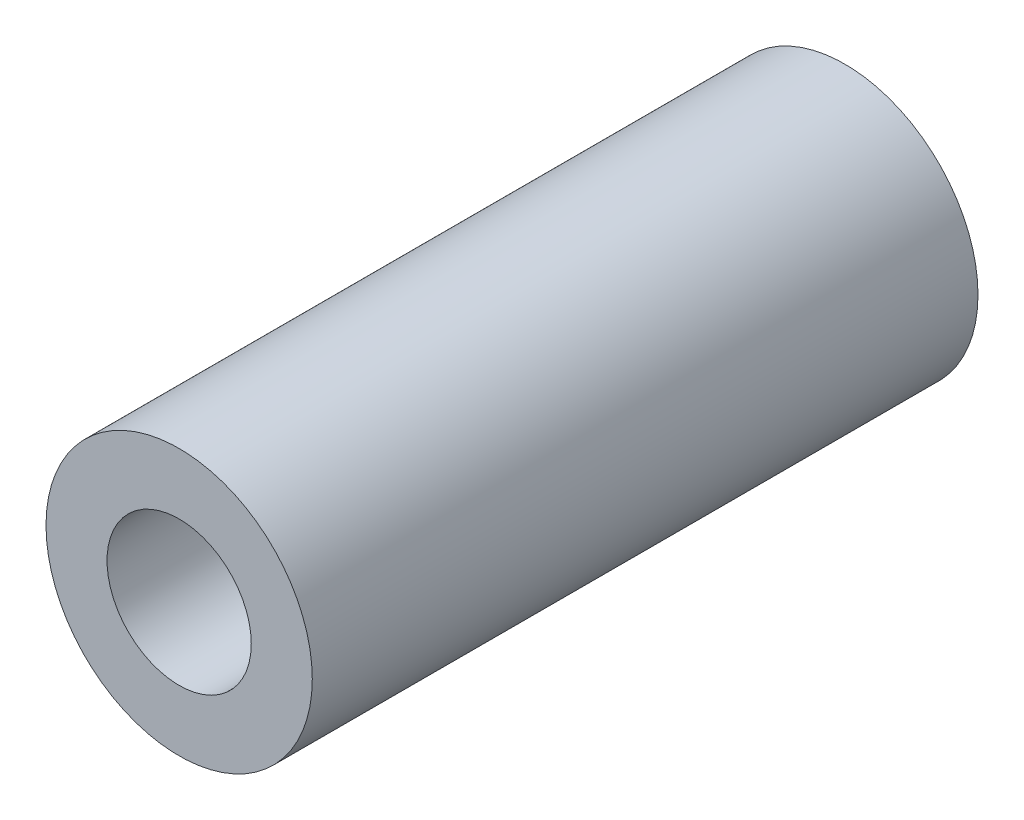
ISO-10303-21;
HEADER;
FILE_DESCRIPTION(('STEP AP214'),'2;1');
FILE_NAME('part.step','',(''),(''),'','','');
FILE_SCHEMA(('AUTOMOTIVE_DESIGN { 1 0 10303 214 1 1 1 1 }'));
ENDSEC;
DATA;
#1=APPLICATION_CONTEXT('core data for automotive mechanical design processes');
#2=APPLICATION_PROTOCOL_DEFINITION('international standard','automotive_design',2000,#1);
#3=PRODUCT_CONTEXT('',#1,'mechanical');
#4=PRODUCT('Part','Part','',(#3));
#5=PRODUCT_RELATED_PRODUCT_CATEGORY('part','',(#4));
#6=PRODUCT_DEFINITION_FORMATION('','',#4);
#7=PRODUCT_DEFINITION_CONTEXT('part definition',#1,'design');
#8=PRODUCT_DEFINITION('design','',#6,#7);
#9=PRODUCT_DEFINITION_SHAPE('','',#8);
#10=(LENGTH_UNIT() NAMED_UNIT(*) SI_UNIT(.MILLI.,.METRE.));
#11=(NAMED_UNIT(*) PLANE_ANGLE_UNIT() SI_UNIT($,.RADIAN.));
#12=(NAMED_UNIT(*) SI_UNIT($,.STERADIAN.) SOLID_ANGLE_UNIT());
#13=UNCERTAINTY_MEASURE_WITH_UNIT(LENGTH_MEASURE(1.E-05),#10,'distance_accuracy_value','');
#14=(GEOMETRIC_REPRESENTATION_CONTEXT(3) GLOBAL_UNCERTAINTY_ASSIGNED_CONTEXT((#13)) GLOBAL_UNIT_ASSIGNED_CONTEXT((#10,
#11,#12)) REPRESENTATION_CONTEXT('',''));
#15=CARTESIAN_POINT('',(0.,0.,0.));
#16=DIRECTION('',(0.,0.,1.));
#17=DIRECTION('',(1.,0.,0.));
#18=AXIS2_PLACEMENT_3D('',#15,#16,#17);
#19=CARTESIAN_POINT('',(0.,0.,-5.));
#20=DIRECTION('',(0.,0.,1.));
#21=DIRECTION('',(1.,0.,0.));
#22=AXIS2_PLACEMENT_3D('',#19,#20,#21);
#23=CYLINDRICAL_SURFACE('',#22,6.);
#24=CARTESIAN_POINT('',(0.,0.,-5.));
#25=DIRECTION('',(0.,0.,1.));
#26=DIRECTION('',(1.,0.,0.));
#27=AXIS2_PLACEMENT_3D('',#24,#25,#26);
#28=CIRCLE('',#27,6.);
#29=CARTESIAN_POINT('',(6.,0.,-5.));
#30=VERTEX_POINT('',#29);
#31=EDGE_CURVE('E10',#30,#30,#28,.T.);
#32=ORIENTED_EDGE('',*,*,#31,.T.);
#33=EDGE_LOOP('',(#32));
#34=FACE_BOUND('',#33,.T.);
#35=CARTESIAN_POINT('',(0.,0.,25.));
#36=DIRECTION('',(0.,0.,1.));
#37=DIRECTION('',(1.,0.,0.));
#38=AXIS2_PLACEMENT_3D('',#35,#36,#37);
#39=CIRCLE('',#38,6.);
#40=CARTESIAN_POINT('',(6.,0.,25.));
#41=VERTEX_POINT('',#40);
#42=EDGE_CURVE('E45',#41,#41,#39,.T.);
#43=ORIENTED_EDGE('',*,*,#42,.F.);
#44=EDGE_LOOP('',(#43));
#45=FACE_BOUND('',#44,.T.);
#46=ADVANCED_FACE('F39',(#34,#45),#23,.T.);
#47=CARTESIAN_POINT('',(0.,0.,-5.));
#48=DIRECTION('',(0.,0.,1.));
#49=DIRECTION('',(1.,0.,0.));
#50=AXIS2_PLACEMENT_3D('',#47,#48,#49);
#51=PLANE('',#50);
#52=ORIENTED_EDGE('',*,*,#31,.F.);
#53=EDGE_LOOP('',(#52));
#54=FACE_BOUND('',#53,.T.);
#55=ADVANCED_FACE('F63',(#54),#51,.F.);
#56=CARTESIAN_POINT('',(0.,0.,25.));
#57=DIRECTION('',(0.,0.,1.));
#58=DIRECTION('',(1.,0.,0.));
#59=AXIS2_PLACEMENT_3D('',#56,#57,#58);
#60=PLANE('',#59);
#61=CARTESIAN_POINT('',(0.,0.,25.));
#62=DIRECTION('',(0.,0.,1.));
#63=DIRECTION('',(1.,0.,0.));
#64=AXIS2_PLACEMENT_3D('',#61,#62,#63);
#65=CIRCLE('',#64,3.25);
#66=CARTESIAN_POINT('',(3.25,0.,25.));
#67=VERTEX_POINT('',#66);
#68=EDGE_CURVE('E53',#67,#67,#65,.T.);
#69=ORIENTED_EDGE('',*,*,#68,.F.);
#70=EDGE_LOOP('',(#69));
#71=FACE_BOUND('',#70,.T.);
#72=ORIENTED_EDGE('',*,*,#42,.T.);
#73=EDGE_LOOP('',(#72));
#74=FACE_BOUND('',#73,.T.);
#75=ADVANCED_FACE('F61',(#71,#74),#60,.T.);
#76=CARTESIAN_POINT('',(0.,0.,0.));
#77=DIRECTION('',(0.,0.,1.));
#78=DIRECTION('',(1.,0.,0.));
#79=AXIS2_PLACEMENT_3D('',#76,#77,#78);
#80=CYLINDRICAL_SURFACE('',#79,3.25);
#81=CARTESIAN_POINT('',(0.,0.,0.));
#82=DIRECTION('',(0.,0.,1.));
#83=DIRECTION('',(1.,0.,0.));
#84=AXIS2_PLACEMENT_3D('',#81,#82,#83);
#85=CIRCLE('',#84,3.25);
#86=CARTESIAN_POINT('',(3.25,0.,0.));
#87=VERTEX_POINT('',#86);
#88=EDGE_CURVE('E49',#87,#87,#85,.T.);
#89=ORIENTED_EDGE('',*,*,#88,.F.);
#90=EDGE_LOOP('',(#89));
#91=FACE_BOUND('',#90,.T.);
#92=ORIENTED_EDGE('',*,*,#68,.T.);
#93=EDGE_LOOP('',(#92));
#94=FACE_BOUND('',#93,.T.);
#95=ADVANCED_FACE('F59',(#91,#94),#80,.F.);
#96=CARTESIAN_POINT('',(0.,0.,0.));
#97=DIRECTION('',(0.,0.,1.));
#98=DIRECTION('',(1.,0.,0.));
#99=AXIS2_PLACEMENT_3D('',#96,#97,#98);
#100=PLANE('',#99);
#101=ORIENTED_EDGE('',*,*,#88,.T.);
#102=EDGE_LOOP('',(#101));
#103=FACE_BOUND('',#102,.T.);
#104=ADVANCED_FACE('F69',(#103),#100,.T.);
#105=CLOSED_SHELL('',(#46,#55,#75,#95,#104));
#106=MANIFOLD_SOLID_BREP('B2',#105);
#107=ADVANCED_BREP_SHAPE_REPRESENTATION('',(#18,#106),#14);
#108=SHAPE_DEFINITION_REPRESENTATION(#9,#107);
ENDSEC;
END-ISO-10303-21;
